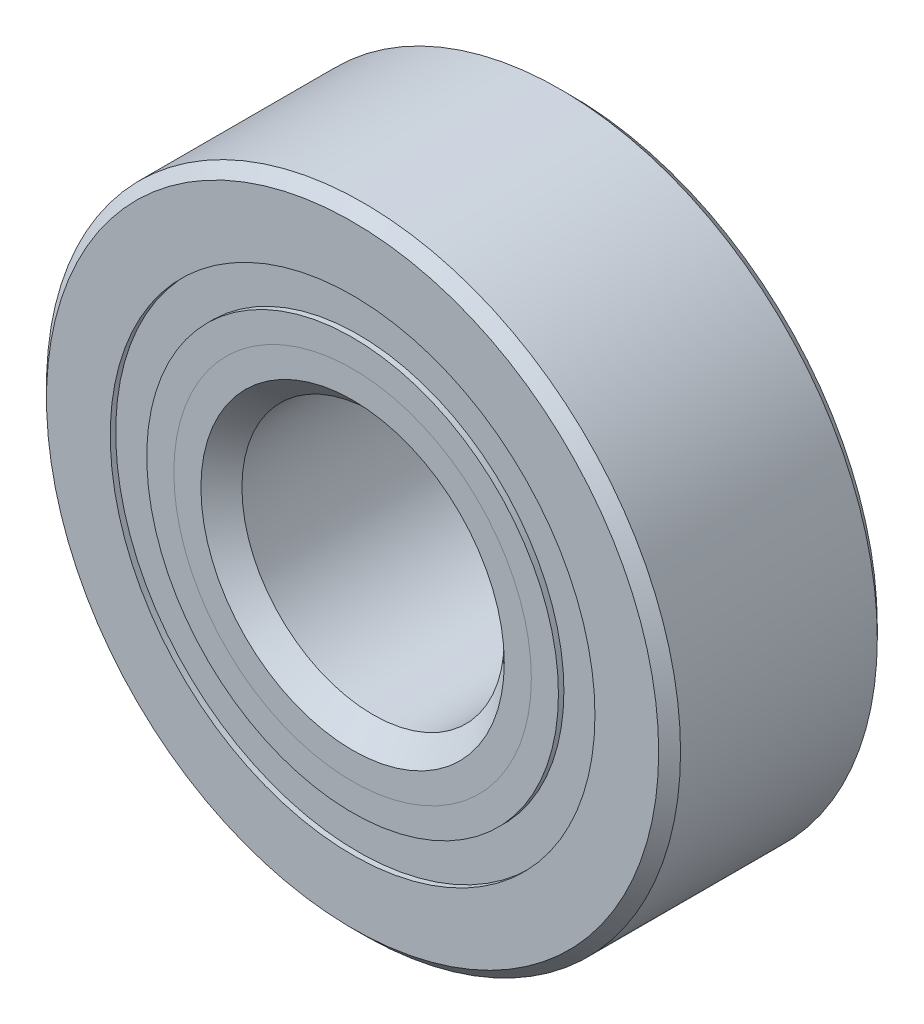
ISO-10303-21;
HEADER;
FILE_DESCRIPTION(('STEP AP214'),'2;1');
FILE_NAME('part.step','',(''),(''),'','','');
FILE_SCHEMA(('AUTOMOTIVE_DESIGN { 1 0 10303 214 1 1 1 1 }'));
ENDSEC;
DATA;
#1=APPLICATION_CONTEXT('core data for automotive mechanical design processes');
#2=APPLICATION_PROTOCOL_DEFINITION('international standard','automotive_design',2000,#1);
#3=PRODUCT_CONTEXT('',#1,'mechanical');
#4=PRODUCT('Part','Part','',(#3));
#5=PRODUCT_RELATED_PRODUCT_CATEGORY('part','',(#4));
#6=PRODUCT_DEFINITION_FORMATION('','',#4);
#7=PRODUCT_DEFINITION_CONTEXT('part definition',#1,'design');
#8=PRODUCT_DEFINITION('design','',#6,#7);
#9=PRODUCT_DEFINITION_SHAPE('','',#8);
#10=(LENGTH_UNIT() NAMED_UNIT(*) SI_UNIT(.MILLI.,.METRE.));
#11=(NAMED_UNIT(*) PLANE_ANGLE_UNIT() SI_UNIT($,.RADIAN.));
#12=(NAMED_UNIT(*) SI_UNIT($,.STERADIAN.) SOLID_ANGLE_UNIT());
#13=UNCERTAINTY_MEASURE_WITH_UNIT(LENGTH_MEASURE(1.E-05),#10,'distance_accuracy_value','');
#14=(GEOMETRIC_REPRESENTATION_CONTEXT(3) GLOBAL_UNCERTAINTY_ASSIGNED_CONTEXT((#13)) GLOBAL_UNIT_ASSIGNED_CONTEXT((#10,
#11,#12)) REPRESENTATION_CONTEXT('',''));
#15=CARTESIAN_POINT('',(0.,0.,0.));
#16=DIRECTION('',(0.,0.,1.));
#17=DIRECTION('',(1.,0.,0.));
#18=AXIS2_PLACEMENT_3D('',#15,#16,#17);
#19=CARTESIAN_POINT('',(0.,8.79884958791209,-3.7703125));
#20=DIRECTION('',(0.,0.,1.));
#21=DIRECTION('',(1.,0.,0.));
#22=AXIS2_PLACEMENT_3D('',#19,#20,#21);
#23=PLANE('',#22);
#24=CARTESIAN_POINT('',(0.,0.,-3.7703125));
#25=DIRECTION('',(0.,0.,1.));
#26=DIRECTION('',(1.,0.,0.));
#27=AXIS2_PLACEMENT_3D('',#24,#25,#26);
#28=CIRCLE('',#27,8.79884958791209);
#29=CARTESIAN_POINT('',(8.79884958791209,0.,-3.7703125));
#30=VERTEX_POINT('',#29);
#31=EDGE_CURVE('E55',#30,#30,#28,.T.);
#32=ORIENTED_EDGE('',*,*,#31,.F.);
#33=EDGE_LOOP('',(#32));
#34=FACE_BOUND('',#33,.T.);
#35=CARTESIAN_POINT('',(0.,0.,-3.7703125));
#36=DIRECTION('',(0.,0.,1.));
#37=DIRECTION('',(1.,0.,0.));
#38=AXIS2_PLACEMENT_3D('',#35,#36,#37);
#39=CIRCLE('',#38,7.47302541208792);
#40=CARTESIAN_POINT('',(7.47302541208792,0.,-3.7703125));
#41=VERTEX_POINT('',#40);
#42=EDGE_CURVE('E11',#41,#41,#39,.T.);
#43=ORIENTED_EDGE('',*,*,#42,.T.);
#44=EDGE_LOOP('',(#43));
#45=FACE_BOUND('',#44,.T.);
#46=ADVANCED_FACE('F41',(#34,#45),#23,.F.);
#47=CARTESIAN_POINT('',(0.,0.,3.96875));
#48=DIRECTION('',(0.,0.,1.));
#49=DIRECTION('',(1.,0.,0.));
#50=AXIS2_PLACEMENT_3D('',#47,#48,#49);
#51=CYLINDRICAL_SURFACE('',#50,7.47302541208792);
#52=ORIENTED_EDGE('',*,*,#42,.F.);
#53=EDGE_LOOP('',(#52));
#54=FACE_BOUND('',#53,.T.);
#55=CARTESIAN_POINT('',(0.,0.,-1.88434509807669));
#56=DIRECTION('',(0.,0.,1.));
#57=DIRECTION('',(1.,0.,0.));
#58=AXIS2_PLACEMENT_3D('',#55,#56,#57);
#59=CIRCLE('',#58,7.47302541208792);
#60=CARTESIAN_POINT('',(7.47302541208792,0.,-1.88434509807669));
#61=VERTEX_POINT('',#60);
#62=EDGE_CURVE('E47',#61,#61,#59,.T.);
#63=ORIENTED_EDGE('',*,*,#62,.T.);
#64=EDGE_LOOP('',(#63));
#65=FACE_BOUND('',#64,.T.);
#66=ADVANCED_FACE('F64',(#54,#65),#51,.F.);
#67=CARTESIAN_POINT('',(0.,8.79884958791209,-1.88434509807669));
#68=DIRECTION('',(0.,0.,-1.));
#69=DIRECTION('',(-1.,0.,0.));
#70=AXIS2_PLACEMENT_3D('',#67,#68,#69);
#71=PLANE('',#70);
#72=ORIENTED_EDGE('',*,*,#62,.F.);
#73=EDGE_LOOP('',(#72));
#74=FACE_BOUND('',#73,.T.);
#75=CARTESIAN_POINT('',(0.,0.,-1.88434509807669));
#76=DIRECTION('',(0.,0.,1.));
#77=DIRECTION('',(1.,0.,0.));
#78=AXIS2_PLACEMENT_3D('',#75,#76,#77);
#79=CIRCLE('',#78,8.79884958791209);
#80=CARTESIAN_POINT('',(8.79884958791209,0.,-1.88434509807669));
#81=VERTEX_POINT('',#80);
#82=EDGE_CURVE('E51',#81,#81,#79,.T.);
#83=ORIENTED_EDGE('',*,*,#82,.T.);
#84=EDGE_LOOP('',(#83));
#85=FACE_BOUND('',#84,.T.);
#86=ADVANCED_FACE('F68',(#74,#85),#71,.F.);
#87=CARTESIAN_POINT('',(0.,0.,3.96875));
#88=DIRECTION('',(0.,0.,1.));
#89=DIRECTION('',(1.,0.,0.));
#90=AXIS2_PLACEMENT_3D('',#87,#88,#89);
#91=CYLINDRICAL_SURFACE('',#90,8.79884958791209);
#92=ORIENTED_EDGE('',*,*,#82,.F.);
#93=EDGE_LOOP('',(#92));
#94=FACE_BOUND('',#93,.T.);
#95=ORIENTED_EDGE('',*,*,#31,.T.);
#96=EDGE_LOOP('',(#95));
#97=FACE_BOUND('',#96,.T.);
#98=ADVANCED_FACE('F61',(#94,#97),#91,.T.);
#99=CLOSED_SHELL('',(#46,#66,#86,#98));
#100=MANIFOLD_SOLID_BREP('B2',#99);
#101=CARTESIAN_POINT('',(0.,8.79884958791209,3.7703125));
#102=DIRECTION('',(0.,0.,-1.));
#103=DIRECTION('',(-1.,0.,0.));
#104=AXIS2_PLACEMENT_3D('',#101,#102,#103);
#105=PLANE('',#104);
#106=CARTESIAN_POINT('',(0.,0.,3.7703125));
#107=DIRECTION('',(0.,0.,1.));
#108=DIRECTION('',(1.,0.,0.));
#109=AXIS2_PLACEMENT_3D('',#106,#107,#108);
#110=CIRCLE('',#109,7.47302541208791);
#111=CARTESIAN_POINT('',(7.47302541208791,0.,3.7703125));
#112=VERTEX_POINT('',#111);
#113=EDGE_CURVE('E40',#112,#112,#110,.T.);
#114=ORIENTED_EDGE('',*,*,#113,.F.);
#115=EDGE_LOOP('',(#114));
#116=FACE_BOUND('',#115,.T.);
#117=CARTESIAN_POINT('',(0.,0.,3.7703125));
#118=DIRECTION('',(0.,0.,1.));
#119=DIRECTION('',(1.,0.,0.));
#120=AXIS2_PLACEMENT_3D('',#117,#118,#119);
#121=CIRCLE('',#120,8.79884958791209);
#122=CARTESIAN_POINT('',(8.79884958791209,0.,3.7703125));
#123=VERTEX_POINT('',#122);
#124=EDGE_CURVE('E122',#123,#123,#121,.T.);
#125=ORIENTED_EDGE('',*,*,#124,.T.);
#126=EDGE_LOOP('',(#125));
#127=FACE_BOUND('',#126,.T.);
#128=ADVANCED_FACE('F108',(#116,#127),#105,.F.);
#129=CARTESIAN_POINT('',(0.,0.,3.96875));
#130=DIRECTION('',(0.,0.,1.));
#131=DIRECTION('',(1.,0.,0.));
#132=AXIS2_PLACEMENT_3D('',#129,#130,#131);
#133=CYLINDRICAL_SURFACE('',#132,7.47302541208791);
#134=CARTESIAN_POINT('',(0.,0.,1.88434509807669));
#135=DIRECTION('',(0.,0.,1.));
#136=DIRECTION('',(1.,0.,0.));
#137=AXIS2_PLACEMENT_3D('',#134,#135,#136);
#138=CIRCLE('',#137,7.47302541208791);
#139=CARTESIAN_POINT('',(7.47302541208791,0.,1.88434509807669));
#140=VERTEX_POINT('',#139);
#141=EDGE_CURVE('E114',#140,#140,#138,.T.);
#142=ORIENTED_EDGE('',*,*,#141,.F.);
#143=EDGE_LOOP('',(#142));
#144=FACE_BOUND('',#143,.T.);
#145=ORIENTED_EDGE('',*,*,#113,.T.);
#146=EDGE_LOOP('',(#145));
#147=FACE_BOUND('',#146,.T.);
#148=ADVANCED_FACE('F137',(#144,#147),#133,.F.);
#149=CARTESIAN_POINT('',(0.,8.79884958791209,1.88434509807669));
#150=DIRECTION('',(0.,0.,1.));
#151=DIRECTION('',(1.,0.,0.));
#152=AXIS2_PLACEMENT_3D('',#149,#150,#151);
#153=PLANE('',#152);
#154=CARTESIAN_POINT('',(0.,0.,1.88434509807669));
#155=DIRECTION('',(0.,0.,1.));
#156=DIRECTION('',(1.,0.,0.));
#157=AXIS2_PLACEMENT_3D('',#154,#155,#156);
#158=CIRCLE('',#157,8.79884958791209);
#159=CARTESIAN_POINT('',(8.79884958791209,0.,1.88434509807669));
#160=VERTEX_POINT('',#159);
#161=EDGE_CURVE('E118',#160,#160,#158,.T.);
#162=ORIENTED_EDGE('',*,*,#161,.F.);
#163=EDGE_LOOP('',(#162));
#164=FACE_BOUND('',#163,.T.);
#165=ORIENTED_EDGE('',*,*,#141,.T.);
#166=EDGE_LOOP('',(#165));
#167=FACE_BOUND('',#166,.T.);
#168=ADVANCED_FACE('F132',(#164,#167),#153,.F.);
#169=CARTESIAN_POINT('',(0.,0.,3.96875));
#170=DIRECTION('',(0.,0.,1.));
#171=DIRECTION('',(1.,0.,0.));
#172=AXIS2_PLACEMENT_3D('',#169,#170,#171);
#173=CYLINDRICAL_SURFACE('',#172,8.79884958791209);
#174=ORIENTED_EDGE('',*,*,#124,.F.);
#175=EDGE_LOOP('',(#174));
#176=FACE_BOUND('',#175,.T.);
#177=ORIENTED_EDGE('',*,*,#161,.T.);
#178=EDGE_LOOP('',(#177));
#179=FACE_BOUND('',#178,.T.);
#180=ADVANCED_FACE('F129',(#176,#179),#173,.T.);
#181=CLOSED_SHELL('',(#128,#148,#168,#180));
#182=MANIFOLD_SOLID_BREP('B6',#181);
#183=CARTESIAN_POINT('',(-4.06796874999991,7.04592855860251,0.));
#184=DIRECTION('',(0.,0.,1.));
#185=DIRECTION('',(-0.499999999999989,0.866025403784445,0.));
#186=AXIS2_PLACEMENT_3D('',#183,#184,#185);
#187=SPHERICAL_SURFACE('',#186,1.88434509807669);
#188=CARTESIAN_POINT('',(-4.06796874999991,7.04592855860251,1.88434509807669));
#189=VERTEX_POINT('',#188);
#190=VERTEX_LOOP('',#189);
#191=FACE_BOUND('',#190,.T.);
#192=ADVANCED_FACE('F175',(#191),#187,.T.);
#193=CLOSED_SHELL('',(#192));
#194=MANIFOLD_SOLID_BREP('B35',#193);
#195=CARTESIAN_POINT('',(-7.04592855860241,4.06796875000008,0.));
#196=DIRECTION('',(0.,0.,1.));
#197=DIRECTION('',(-0.866025403784433,0.50000000000001,0.));
#198=AXIS2_PLACEMENT_3D('',#195,#196,#197);
#199=SPHERICAL_SURFACE('',#198,1.88434509807669);
#200=CARTESIAN_POINT('',(-7.04592855860241,4.06796875000008,1.88434509807669));
#201=VERTEX_POINT('',#200);
#202=VERTEX_LOOP('',#201);
#203=FACE_BOUND('',#202,.T.);
#204=ADVANCED_FACE('F206',(#203),#199,.T.);
#205=CLOSED_SHELL('',(#204));
#206=MANIFOLD_SOLID_BREP('B104',#205);
#207=CARTESIAN_POINT('',(-8.1359375,0.,0.));
#208=DIRECTION('',(0.,0.,1.));
#209=DIRECTION('',(-1.,0.,0.));
#210=AXIS2_PLACEMENT_3D('',#207,#208,#209);
#211=SPHERICAL_SURFACE('',#210,1.88434509807669);
#212=CARTESIAN_POINT('',(-8.1359375,0.,1.88434509807669));
#213=VERTEX_POINT('',#212);
#214=VERTEX_LOOP('',#213);
#215=FACE_BOUND('',#214,.T.);
#216=ADVANCED_FACE('F237',(#215),#211,.T.);
#217=CLOSED_SHELL('',(#216));
#218=MANIFOLD_SOLID_BREP('B171',#217);
#219=CARTESIAN_POINT('',(-7.04592855860249,-4.06796874999993,0.));
#220=DIRECTION('',(0.,0.,1.));
#221=DIRECTION('',(-0.866025403784443,-0.499999999999992,0.));
#222=AXIS2_PLACEMENT_3D('',#219,#220,#221);
#223=SPHERICAL_SURFACE('',#222,1.88434509807669);
#224=CARTESIAN_POINT('',(-7.04592855860249,-4.06796874999993,1.88434509807669));
#225=VERTEX_POINT('',#224);
#226=VERTEX_LOOP('',#225);
#227=FACE_BOUND('',#226,.T.);
#228=ADVANCED_FACE('F268',(#227),#223,.T.);
#229=CLOSED_SHELL('',(#228));
#230=MANIFOLD_SOLID_BREP('B202',#229);
#231=CARTESIAN_POINT('',(-4.06796875000006,-7.04592855860242,0.));
#232=DIRECTION('',(0.,0.,1.));
#233=DIRECTION('',(-0.500000000000007,-0.866025403784435,0.));
#234=AXIS2_PLACEMENT_3D('',#231,#232,#233);
#235=SPHERICAL_SURFACE('',#234,1.88434509807669);
#236=CARTESIAN_POINT('',(-4.06796875000006,-7.04592855860242,1.88434509807669));
#237=VERTEX_POINT('',#236);
#238=VERTEX_LOOP('',#237);
#239=FACE_BOUND('',#238,.T.);
#240=ADVANCED_FACE('F299',(#239),#235,.T.);
#241=CLOSED_SHELL('',(#240));
#242=MANIFOLD_SOLID_BREP('B233',#241);
#243=CARTESIAN_POINT('',(0.,-8.1359375,0.));
#244=DIRECTION('',(0.,0.,1.));
#245=DIRECTION('',(0.,-1.,0.));
#246=AXIS2_PLACEMENT_3D('',#243,#244,#245);
#247=SPHERICAL_SURFACE('',#246,1.88434509807669);
#248=CARTESIAN_POINT('',(0.,-8.1359375,1.88434509807669));
#249=VERTEX_POINT('',#248);
#250=VERTEX_LOOP('',#249);
#251=FACE_BOUND('',#250,.T.);
#252=ADVANCED_FACE('F330',(#251),#247,.T.);
#253=CLOSED_SHELL('',(#252));
#254=MANIFOLD_SOLID_BREP('B264',#253);
#255=CARTESIAN_POINT('',(4.06796874999996,-7.04592855860248,0.));
#256=DIRECTION('',(0.,0.,1.));
#257=DIRECTION('',(0.499999999999995,-0.866025403784442,0.));
#258=AXIS2_PLACEMENT_3D('',#255,#256,#257);
#259=SPHERICAL_SURFACE('',#258,1.88434509807669);
#260=CARTESIAN_POINT('',(4.06796874999996,-7.04592855860248,1.88434509807669));
#261=VERTEX_POINT('',#260);
#262=VERTEX_LOOP('',#261);
#263=FACE_BOUND('',#262,.T.);
#264=ADVANCED_FACE('F361',(#263),#259,.T.);
#265=CLOSED_SHELL('',(#264));
#266=MANIFOLD_SOLID_BREP('B295',#265);
#267=CARTESIAN_POINT('',(7.04592855860244,-4.06796875000003,0.));
#268=DIRECTION('',(0.,0.,1.));
#269=DIRECTION('',(0.866025403784436,-0.500000000000004,0.));
#270=AXIS2_PLACEMENT_3D('',#267,#268,#269);
#271=SPHERICAL_SURFACE('',#270,1.88434509807669);
#272=CARTESIAN_POINT('',(7.04592855860244,-4.06796875000003,1.88434509807669));
#273=VERTEX_POINT('',#272);
#274=VERTEX_LOOP('',#273);
#275=FACE_BOUND('',#274,.T.);
#276=ADVANCED_FACE('F392',(#275),#271,.T.);
#277=CLOSED_SHELL('',(#276));
#278=MANIFOLD_SOLID_BREP('B326',#277);
#279=CARTESIAN_POINT('',(8.1359375,0.,0.));
#280=DIRECTION('',(0.,0.,1.));
#281=DIRECTION('',(1.,0.,0.));
#282=AXIS2_PLACEMENT_3D('',#279,#280,#281);
#283=SPHERICAL_SURFACE('',#282,1.88434509807669);
#284=CARTESIAN_POINT('',(8.1359375,0.,1.88434509807669));
#285=VERTEX_POINT('',#284);
#286=VERTEX_LOOP('',#285);
#287=FACE_BOUND('',#286,.T.);
#288=ADVANCED_FACE('F423',(#287),#283,.T.);
#289=CLOSED_SHELL('',(#288));
#290=MANIFOLD_SOLID_BREP('B357',#289);
#291=CARTESIAN_POINT('',(7.04592855860247,4.06796874999998,0.));
#292=DIRECTION('',(0.,0.,1.));
#293=DIRECTION('',(0.86602540378444,0.499999999999998,0.));
#294=AXIS2_PLACEMENT_3D('',#291,#292,#293);
#295=SPHERICAL_SURFACE('',#294,1.88434509807669);
#296=CARTESIAN_POINT('',(7.04592855860247,4.06796874999998,1.88434509807669));
#297=VERTEX_POINT('',#296);
#298=VERTEX_LOOP('',#297);
#299=FACE_BOUND('',#298,.T.);
#300=ADVANCED_FACE('F454',(#299),#295,.T.);
#301=CLOSED_SHELL('',(#300));
#302=MANIFOLD_SOLID_BREP('B388',#301);
#303=CARTESIAN_POINT('',(4.06796875000001,7.04592855860245,0.));
#304=DIRECTION('',(0.,0.,1.));
#305=DIRECTION('',(0.500000000000001,0.866025403784438,0.));
#306=AXIS2_PLACEMENT_3D('',#303,#304,#305);
#307=SPHERICAL_SURFACE('',#306,1.88434509807669);
#308=CARTESIAN_POINT('',(4.06796875000001,7.04592855860245,1.88434509807669));
#309=VERTEX_POINT('',#308);
#310=VERTEX_LOOP('',#309);
#311=FACE_BOUND('',#310,.T.);
#312=ADVANCED_FACE('F485',(#311),#307,.T.);
#313=CLOSED_SHELL('',(#312));
#314=MANIFOLD_SOLID_BREP('B419',#313);
#315=CARTESIAN_POINT('',(0.,8.1359375,0.));
#316=DIRECTION('',(0.,0.,1.));
#317=DIRECTION('',(0.,1.,0.));
#318=AXIS2_PLACEMENT_3D('',#315,#316,#317);
#319=SPHERICAL_SURFACE('',#318,1.88434509807669);
#320=CARTESIAN_POINT('',(0.,8.1359375,1.88434509807669));
#321=VERTEX_POINT('',#320);
#322=VERTEX_LOOP('',#321);
#323=FACE_BOUND('',#322,.T.);
#324=ADVANCED_FACE('F518',(#323),#319,.T.);
#325=CLOSED_SHELL('',(#324));
#326=MANIFOLD_SOLID_BREP('B450',#325);
#327=CARTESIAN_POINT('',(0.,6.49003580652479,3.96875));
#328=DIRECTION('',(0.,0.,-1.));
#329=DIRECTION('',(-1.,0.,0.));
#330=AXIS2_PLACEMENT_3D('',#327,#328,#329);
#331=PLANE('',#330);
#332=CARTESIAN_POINT('',(0.,0.,3.96875));
#333=DIRECTION('',(0.,0.,1.));
#334=DIRECTION('',(1.,0.,0.));
#335=AXIS2_PLACEMENT_3D('',#332,#333,#334);
#336=CIRCLE('',#335,5.50704620096166);
#337=CARTESIAN_POINT('',(5.50704620096166,0.,3.96875));
#338=VERTEX_POINT('',#337);
#339=EDGE_CURVE('E572',#338,#338,#336,.T.);
#340=ORIENTED_EDGE('',*,*,#339,.F.);
#341=EDGE_LOOP('',(#340));
#342=FACE_BOUND('',#341,.T.);
#343=CARTESIAN_POINT('',(0.,0.,3.96875));
#344=DIRECTION('',(0.,0.,1.));
#345=DIRECTION('',(1.,0.,0.));
#346=AXIS2_PLACEMENT_3D('',#343,#344,#345);
#347=CIRCLE('',#346,6.49003580652479);
#348=CARTESIAN_POINT('',(6.49003580652479,0.,3.96875));
#349=VERTEX_POINT('',#348);
#350=EDGE_CURVE('E517',#349,#349,#347,.T.);
#351=ORIENTED_EDGE('',*,*,#350,.T.);
#352=EDGE_LOOP('',(#351));
#353=FACE_BOUND('',#352,.T.);
#354=ADVANCED_FACE('F538',(#342,#353),#331,.F.);
#355=CARTESIAN_POINT('',(0.,0.,2.98576039443688));
#356=DIRECTION('',(0.,0.,1.));
#357=DIRECTION('',(1.,0.,0.));
#358=AXIS2_PLACEMENT_3D('',#355,#356,#357);
#359=CONICAL_SURFACE('',#358,5.50704620096166,0.78539816339745);
#360=ORIENTED_EDGE('',*,*,#350,.F.);
#361=EDGE_LOOP('',(#360));
#362=FACE_BOUND('',#361,.T.);
#363=CARTESIAN_POINT('',(0.,0.,2.98576039443688));
#364=DIRECTION('',(0.,0.,1.));
#365=DIRECTION('',(1.,0.,0.));
#366=AXIS2_PLACEMENT_3D('',#363,#364,#365);
#367=CIRCLE('',#366,5.50704620096166);
#368=CARTESIAN_POINT('',(5.50704620096166,0.,2.98576039443688));
#369=VERTEX_POINT('',#368);
#370=EDGE_CURVE('E544',#369,#369,#367,.T.);
#371=ORIENTED_EDGE('',*,*,#370,.T.);
#372=EDGE_LOOP('',(#371));
#373=FACE_BOUND('',#372,.T.);
#374=ADVANCED_FACE('F579',(#362,#373),#359,.T.);
#375=CARTESIAN_POINT('',(0.,0.,3.96875));
#376=DIRECTION('',(0.,0.,1.));
#377=DIRECTION('',(1.,0.,0.));
#378=AXIS2_PLACEMENT_3D('',#375,#376,#377);
#379=CYLINDRICAL_SURFACE('',#378,5.50704620096166);
#380=ORIENTED_EDGE('',*,*,#370,.F.);
#381=EDGE_LOOP('',(#380));
#382=FACE_BOUND('',#381,.T.);
#383=CARTESIAN_POINT('',(0.,0.,0.));
#384=DIRECTION('',(0.,0.,1.));
#385=DIRECTION('',(1.,0.,0.));
#386=AXIS2_PLACEMENT_3D('',#383,#384,#385);
#387=CIRCLE('',#386,5.50704620096166);
#388=CARTESIAN_POINT('',(5.50704620096166,0.,0.));
#389=VERTEX_POINT('',#388);
#390=EDGE_CURVE('E548',#389,#389,#387,.T.);
#391=ORIENTED_EDGE('',*,*,#390,.T.);
#392=EDGE_LOOP('',(#391));
#393=FACE_BOUND('',#392,.T.);
#394=ADVANCED_FACE('F583',(#382,#393),#379,.T.);
#395=CARTESIAN_POINT('',(0.,5.50704620096166,0.));
#396=DIRECTION('',(0.,0.,-1.));
#397=DIRECTION('',(-1.,0.,0.));
#398=AXIS2_PLACEMENT_3D('',#395,#396,#397);
#399=PLANE('',#398);
#400=ORIENTED_EDGE('',*,*,#390,.F.);
#401=EDGE_LOOP('',(#400));
#402=FACE_BOUND('',#401,.T.);
#403=CARTESIAN_POINT('',(0.,0.,0.));
#404=DIRECTION('',(0.,0.,1.));
#405=DIRECTION('',(1.,0.,0.));
#406=AXIS2_PLACEMENT_3D('',#403,#404,#405);
#407=CIRCLE('',#406,6.25159240192331);
#408=CARTESIAN_POINT('',(6.25159240192331,0.,0.));
#409=VERTEX_POINT('',#408);
#410=EDGE_CURVE('E552',#409,#409,#407,.T.);
#411=ORIENTED_EDGE('',*,*,#410,.T.);
#412=EDGE_LOOP('',(#411));
#413=FACE_BOUND('',#412,.T.);
#414=ADVANCED_FACE('F588',(#402,#413),#399,.F.);
#415=CARTESIAN_POINT('',(0.,0.,0.));
#416=DIRECTION('',(0.,0.,1.));
#417=DIRECTION('',(1.,0.,0.));
#418=AXIS2_PLACEMENT_3D('',#415,#416,#417);
#419=TOROIDAL_SURFACE('',#418,8.1359375,1.88434509807669);
#420=ORIENTED_EDGE('',*,*,#410,.F.);
#421=EDGE_LOOP('',(#420));
#422=FACE_BOUND('',#421,.T.);
#423=CARTESIAN_POINT('',(0.,0.,-1.76388888888889));
#424=DIRECTION('',(0.,0.,1.));
#425=DIRECTION('',(1.,0.,0.));
#426=AXIS2_PLACEMENT_3D('',#423,#424,#425);
#427=CIRCLE('',#426,7.47302541208791);
#428=CARTESIAN_POINT('',(7.47302541208791,0.,-1.76388888888889));
#429=VERTEX_POINT('',#428);
#430=EDGE_CURVE('E557',#429,#429,#427,.T.);
#431=ORIENTED_EDGE('',*,*,#430,.T.);
#432=EDGE_LOOP('',(#431));
#433=FACE_BOUND('',#432,.T.);
#434=ADVANCED_FACE('F594',(#422,#433),#419,.F.);
#435=CARTESIAN_POINT('',(0.,0.,3.96875));
#436=DIRECTION('',(0.,0.,1.));
#437=DIRECTION('',(1.,0.,0.));
#438=AXIS2_PLACEMENT_3D('',#435,#436,#437);
#439=CYLINDRICAL_SURFACE('',#438,7.47302541208792);
#440=ORIENTED_EDGE('',*,*,#430,.F.);
#441=EDGE_LOOP('',(#440));
#442=FACE_BOUND('',#441,.T.);
#443=CARTESIAN_POINT('',(0.,0.,-3.96875000000001));
#444=DIRECTION('',(0.,0.,1.));
#445=DIRECTION('',(1.,0.,0.));
#446=AXIS2_PLACEMENT_3D('',#443,#444,#445);
#447=CIRCLE('',#446,7.47302541208792);
#448=CARTESIAN_POINT('',(7.47302541208792,0.,-3.96875000000001));
#449=VERTEX_POINT('',#448);
#450=EDGE_CURVE('E560',#449,#449,#447,.T.);
#451=ORIENTED_EDGE('',*,*,#450,.T.);
#452=EDGE_LOOP('',(#451));
#453=FACE_BOUND('',#452,.T.);
#454=ADVANCED_FACE('F598',(#442,#453),#439,.T.);
#455=CARTESIAN_POINT('',(0.,5.159375,-3.96875));
#456=DIRECTION('',(0.,0.,1.));
#457=DIRECTION('',(1.,0.,0.));
#458=AXIS2_PLACEMENT_3D('',#455,#456,#457);
#459=PLANE('',#458);
#460=ORIENTED_EDGE('',*,*,#450,.F.);
#461=EDGE_LOOP('',(#460));
#462=FACE_BOUND('',#461,.T.);
#463=CARTESIAN_POINT('',(0.,0.,-3.96875));
#464=DIRECTION('',(0.,0.,1.));
#465=DIRECTION('',(1.,0.,0.));
#466=AXIS2_PLACEMENT_3D('',#463,#464,#465);
#467=CIRCLE('',#466,5.159375);
#468=CARTESIAN_POINT('',(5.159375,0.,-3.96875));
#469=VERTEX_POINT('',#468);
#470=EDGE_CURVE('E563',#469,#469,#467,.T.);
#471=ORIENTED_EDGE('',*,*,#470,.T.);
#472=EDGE_LOOP('',(#471));
#473=FACE_BOUND('',#472,.T.);
#474=ADVANCED_FACE('F602',(#462,#473),#459,.F.);
#475=CARTESIAN_POINT('',(0.,0.,-3.571875));
#476=DIRECTION('',(0.,0.,-1.));
#477=DIRECTION('',(-1.,0.,0.));
#478=AXIS2_PLACEMENT_3D('',#475,#476,#477);
#479=CONICAL_SURFACE('',#478,4.7625,0.785398163397448);
#480=ORIENTED_EDGE('',*,*,#470,.F.);
#481=EDGE_LOOP('',(#480));
#482=FACE_BOUND('',#481,.T.);
#483=CARTESIAN_POINT('',(0.,0.,-3.571875));
#484=DIRECTION('',(0.,0.,1.));
#485=DIRECTION('',(1.,0.,0.));
#486=AXIS2_PLACEMENT_3D('',#483,#484,#485);
#487=CIRCLE('',#486,4.7625);
#488=CARTESIAN_POINT('',(4.7625,0.,-3.571875));
#489=VERTEX_POINT('',#488);
#490=EDGE_CURVE('E566',#489,#489,#487,.T.);
#491=ORIENTED_EDGE('',*,*,#490,.T.);
#492=EDGE_LOOP('',(#491));
#493=FACE_BOUND('',#492,.T.);
#494=ADVANCED_FACE('F606',(#482,#493),#479,.F.);
#495=CARTESIAN_POINT('',(0.,0.,3.96875));
#496=DIRECTION('',(0.,0.,1.));
#497=DIRECTION('',(1.,0.,0.));
#498=AXIS2_PLACEMENT_3D('',#495,#496,#497);
#499=CYLINDRICAL_SURFACE('',#498,4.7625);
#500=ORIENTED_EDGE('',*,*,#490,.F.);
#501=EDGE_LOOP('',(#500));
#502=FACE_BOUND('',#501,.T.);
#503=CARTESIAN_POINT('',(0.,0.,3.22420379903835));
#504=DIRECTION('',(0.,0.,1.));
#505=DIRECTION('',(1.,0.,0.));
#506=AXIS2_PLACEMENT_3D('',#503,#504,#505);
#507=CIRCLE('',#506,4.7625);
#508=CARTESIAN_POINT('',(4.7625,0.,3.22420379903835));
#509=VERTEX_POINT('',#508);
#510=EDGE_CURVE('E569',#509,#509,#507,.T.);
#511=ORIENTED_EDGE('',*,*,#510,.T.);
#512=EDGE_LOOP('',(#511));
#513=FACE_BOUND('',#512,.T.);
#514=ADVANCED_FACE('F610',(#502,#513),#499,.F.);
#515=CARTESIAN_POINT('',(0.,0.,3.96875));
#516=DIRECTION('',(0.,0.,1.));
#517=DIRECTION('',(1.,0.,0.));
#518=AXIS2_PLACEMENT_3D('',#515,#516,#517);
#519=CONICAL_SURFACE('',#518,5.50704620096166,0.78539816339745);
#520=ORIENTED_EDGE('',*,*,#510,.F.);
#521=EDGE_LOOP('',(#520));
#522=FACE_BOUND('',#521,.T.);
#523=ORIENTED_EDGE('',*,*,#339,.T.);
#524=EDGE_LOOP('',(#523));
#525=FACE_BOUND('',#524,.T.);
#526=ADVANCED_FACE('F576',(#522,#525),#519,.F.);
#527=CLOSED_SHELL('',(#354,#374,#394,#414,#434,#454,#474,#494,#514,#526));
#528=MANIFOLD_SOLID_BREP('B481',#527);
#529=CARTESIAN_POINT('',(0.,7.47302541208791,3.96875));
#530=DIRECTION('',(0.,0.,-1.));
#531=DIRECTION('',(-1.,0.,0.));
#532=AXIS2_PLACEMENT_3D('',#529,#530,#531);
#533=PLANE('',#532);
#534=CARTESIAN_POINT('',(0.,0.,3.96875));
#535=DIRECTION('',(0.,0.,1.));
#536=DIRECTION('',(1.,0.,0.));
#537=AXIS2_PLACEMENT_3D('',#534,#535,#536);
#538=CIRCLE('',#537,6.49003580652479);
#539=CARTESIAN_POINT('',(6.49003580652479,0.,3.96875));
#540=VERTEX_POINT('',#539);
#541=EDGE_CURVE('E537',#540,#540,#538,.T.);
#542=ORIENTED_EDGE('',*,*,#541,.F.);
#543=EDGE_LOOP('',(#542));
#544=FACE_BOUND('',#543,.T.);
#545=CARTESIAN_POINT('',(0.,0.,3.96875));
#546=DIRECTION('',(0.,0.,1.));
#547=DIRECTION('',(1.,0.,0.));
#548=AXIS2_PLACEMENT_3D('',#545,#546,#547);
#549=CIRCLE('',#548,7.47302541208791);
#550=CARTESIAN_POINT('',(7.47302541208791,0.,3.96875));
#551=VERTEX_POINT('',#550);
#552=EDGE_CURVE('E718',#551,#551,#549,.T.);
#553=ORIENTED_EDGE('',*,*,#552,.T.);
#554=EDGE_LOOP('',(#553));
#555=FACE_BOUND('',#554,.T.);
#556=ADVANCED_FACE('F696',(#544,#555),#533,.F.);
#557=CARTESIAN_POINT('',(0.,0.,3.96875));
#558=DIRECTION('',(0.,0.,1.));
#559=DIRECTION('',(1.,0.,0.));
#560=AXIS2_PLACEMENT_3D('',#557,#558,#559);
#561=CONICAL_SURFACE('',#560,6.49003580652479,0.78539816339745);
#562=CARTESIAN_POINT('',(0.,0.,2.98576039443688));
#563=DIRECTION('',(0.,0.,1.));
#564=DIRECTION('',(1.,0.,0.));
#565=AXIS2_PLACEMENT_3D('',#562,#563,#564);
#566=CIRCLE('',#565,5.50704620096166);
#567=CARTESIAN_POINT('',(5.50704620096166,0.,2.98576039443688));
#568=VERTEX_POINT('',#567);
#569=EDGE_CURVE('E702',#568,#568,#566,.T.);
#570=ORIENTED_EDGE('',*,*,#569,.F.);
#571=EDGE_LOOP('',(#570));
#572=FACE_BOUND('',#571,.T.);
#573=ORIENTED_EDGE('',*,*,#541,.T.);
#574=EDGE_LOOP('',(#573));
#575=FACE_BOUND('',#574,.T.);
#576=ADVANCED_FACE('F743',(#572,#575),#561,.F.);
#577=CARTESIAN_POINT('',(0.,0.,3.96875));
#578=DIRECTION('',(0.,0.,1.));
#579=DIRECTION('',(1.,0.,0.));
#580=AXIS2_PLACEMENT_3D('',#577,#578,#579);
#581=CYLINDRICAL_SURFACE('',#580,5.50704620096166);
#582=CARTESIAN_POINT('',(0.,0.,0.));
#583=DIRECTION('',(0.,0.,1.));
#584=DIRECTION('',(1.,0.,0.));
#585=AXIS2_PLACEMENT_3D('',#582,#583,#584);
#586=CIRCLE('',#585,5.50704620096166);
#587=CARTESIAN_POINT('',(5.50704620096166,0.,0.));
#588=VERTEX_POINT('',#587);
#589=EDGE_CURVE('E706',#588,#588,#586,.T.);
#590=ORIENTED_EDGE('',*,*,#589,.F.);
#591=EDGE_LOOP('',(#590));
#592=FACE_BOUND('',#591,.T.);
#593=ORIENTED_EDGE('',*,*,#569,.T.);
#594=EDGE_LOOP('',(#593));
#595=FACE_BOUND('',#594,.T.);
#596=ADVANCED_FACE('F738',(#592,#595),#581,.F.);
#597=CARTESIAN_POINT('',(0.,5.50704620096166,0.));
#598=DIRECTION('',(0.,0.,1.));
#599=DIRECTION('',(1.,0.,0.));
#600=AXIS2_PLACEMENT_3D('',#597,#598,#599);
#601=PLANE('',#600);
#602=CARTESIAN_POINT('',(0.,0.,0.));
#603=DIRECTION('',(0.,0.,1.));
#604=DIRECTION('',(1.,0.,0.));
#605=AXIS2_PLACEMENT_3D('',#602,#603,#604);
#606=CIRCLE('',#605,6.25159240192331);
#607=CARTESIAN_POINT('',(6.25159240192331,0.,0.));
#608=VERTEX_POINT('',#607);
#609=EDGE_CURVE('E710',#608,#608,#606,.T.);
#610=ORIENTED_EDGE('',*,*,#609,.F.);
#611=EDGE_LOOP('',(#610));
#612=FACE_BOUND('',#611,.T.);
#613=ORIENTED_EDGE('',*,*,#589,.T.);
#614=EDGE_LOOP('',(#613));
#615=FACE_BOUND('',#614,.T.);
#616=ADVANCED_FACE('F732',(#612,#615),#601,.F.);
#617=CARTESIAN_POINT('',(0.,0.,0.));
#618=DIRECTION('',(0.,0.,1.));
#619=DIRECTION('',(1.,0.,0.));
#620=AXIS2_PLACEMENT_3D('',#617,#618,#619);
#621=TOROIDAL_SURFACE('',#620,8.1359375,1.88434509807669);
#622=CARTESIAN_POINT('',(0.,0.,1.76388888888889));
#623=DIRECTION('',(0.,0.,1.));
#624=DIRECTION('',(1.,0.,0.));
#625=AXIS2_PLACEMENT_3D('',#622,#623,#624);
#626=CIRCLE('',#625,7.47302541208791);
#627=CARTESIAN_POINT('',(7.47302541208791,0.,1.76388888888889));
#628=VERTEX_POINT('',#627);
#629=EDGE_CURVE('E715',#628,#628,#626,.T.);
#630=ORIENTED_EDGE('',*,*,#629,.F.);
#631=EDGE_LOOP('',(#630));
#632=FACE_BOUND('',#631,.T.);
#633=ORIENTED_EDGE('',*,*,#609,.T.);
#634=EDGE_LOOP('',(#633));
#635=FACE_BOUND('',#634,.T.);
#636=ADVANCED_FACE('F726',(#632,#635),#621,.F.);
#637=CARTESIAN_POINT('',(0.,0.,3.96875));
#638=DIRECTION('',(0.,0.,1.));
#639=DIRECTION('',(1.,0.,0.));
#640=AXIS2_PLACEMENT_3D('',#637,#638,#639);
#641=CYLINDRICAL_SURFACE('',#640,7.47302541208791);
#642=ORIENTED_EDGE('',*,*,#552,.F.);
#643=EDGE_LOOP('',(#642));
#644=FACE_BOUND('',#643,.T.);
#645=ORIENTED_EDGE('',*,*,#629,.T.);
#646=EDGE_LOOP('',(#645));
#647=FACE_BOUND('',#646,.T.);
#648=ADVANCED_FACE('F723',(#644,#647),#641,.T.);
#649=CLOSED_SHELL('',(#556,#576,#596,#616,#636,#648));
#650=MANIFOLD_SOLID_BREP('B512',#649);
#651=CARTESIAN_POINT('',(0.,0.,3.571875));
#652=DIRECTION('',(0.,0.,-1.));
#653=DIRECTION('',(-1.,0.,0.));
#654=AXIS2_PLACEMENT_3D('',#651,#652,#653);
#655=CONICAL_SURFACE('',#654,11.509375,0.785398163397445);
#656=CARTESIAN_POINT('',(0.,0.,3.96875));
#657=DIRECTION('',(0.,0.,1.));
#658=DIRECTION('',(1.,0.,0.));
#659=AXIS2_PLACEMENT_3D('',#656,#657,#658);
#660=CIRCLE('',#659,11.1125);
#661=CARTESIAN_POINT('',(11.1125,0.,3.96875));
#662=VERTEX_POINT('',#661);
#663=EDGE_CURVE('E815',#662,#662,#660,.T.);
#664=ORIENTED_EDGE('',*,*,#663,.F.);
#665=EDGE_LOOP('',(#664));
#666=FACE_BOUND('',#665,.T.);
#667=CARTESIAN_POINT('',(0.,0.,3.571875));
#668=DIRECTION('',(0.,0.,1.));
#669=DIRECTION('',(1.,0.,0.));
#670=AXIS2_PLACEMENT_3D('',#667,#668,#669);
#671=CIRCLE('',#670,11.509375);
#672=CARTESIAN_POINT('',(11.509375,0.,3.571875));
#673=VERTEX_POINT('',#672);
#674=EDGE_CURVE('E695',#673,#673,#671,.T.);
#675=ORIENTED_EDGE('',*,*,#674,.T.);
#676=EDGE_LOOP('',(#675));
#677=FACE_BOUND('',#676,.T.);
#678=ADVANCED_FACE('F787',(#666,#677),#655,.T.);
#679=CARTESIAN_POINT('',(0.,0.,3.96875));
#680=DIRECTION('',(0.,0.,1.));
#681=DIRECTION('',(1.,0.,0.));
#682=AXIS2_PLACEMENT_3D('',#679,#680,#681);
#683=CYLINDRICAL_SURFACE('',#682,11.509375);
#684=ORIENTED_EDGE('',*,*,#674,.F.);
#685=EDGE_LOOP('',(#684));
#686=FACE_BOUND('',#685,.T.);
#687=CARTESIAN_POINT('',(0.,0.,-3.571875));
#688=DIRECTION('',(0.,0.,1.));
#689=DIRECTION('',(1.,0.,0.));
#690=AXIS2_PLACEMENT_3D('',#687,#688,#689);
#691=CIRCLE('',#690,11.509375);
#692=CARTESIAN_POINT('',(11.509375,0.,-3.571875));
#693=VERTEX_POINT('',#692);
#694=EDGE_CURVE('E793',#693,#693,#691,.T.);
#695=ORIENTED_EDGE('',*,*,#694,.T.);
#696=EDGE_LOOP('',(#695));
#697=FACE_BOUND('',#696,.T.);
#698=ADVANCED_FACE('F822',(#686,#697),#683,.T.);
#699=CARTESIAN_POINT('',(0.,0.,-3.96875000000001));
#700=DIRECTION('',(0.,0.,1.));
#701=DIRECTION('',(1.,0.,0.));
#702=AXIS2_PLACEMENT_3D('',#699,#700,#701);
#703=CONICAL_SURFACE('',#702,11.1125,0.785398163397444);
#704=ORIENTED_EDGE('',*,*,#694,.F.);
#705=EDGE_LOOP('',(#704));
#706=FACE_BOUND('',#705,.T.);
#707=CARTESIAN_POINT('',(0.,0.,-3.96875000000001));
#708=DIRECTION('',(0.,0.,1.));
#709=DIRECTION('',(1.,0.,0.));
#710=AXIS2_PLACEMENT_3D('',#707,#708,#709);
#711=CIRCLE('',#710,11.1125);
#712=CARTESIAN_POINT('',(11.1125,0.,-3.96875000000001));
#713=VERTEX_POINT('',#712);
#714=EDGE_CURVE('E797',#713,#713,#711,.T.);
#715=ORIENTED_EDGE('',*,*,#714,.T.);
#716=EDGE_LOOP('',(#715));
#717=FACE_BOUND('',#716,.T.);
#718=ADVANCED_FACE('F826',(#706,#717),#703,.T.);
#719=CARTESIAN_POINT('',(0.,11.1125,-3.96875000000001));
#720=DIRECTION('',(0.,0.,1.));
#721=DIRECTION('',(1.,0.,0.));
#722=AXIS2_PLACEMENT_3D('',#719,#720,#721);
#723=PLANE('',#722);
#724=ORIENTED_EDGE('',*,*,#714,.F.);
#725=EDGE_LOOP('',(#724));
#726=FACE_BOUND('',#725,.T.);
#727=CARTESIAN_POINT('',(0.,0.,-3.96875000000001));
#728=DIRECTION('',(0.,0.,1.));
#729=DIRECTION('',(1.,0.,0.));
#730=AXIS2_PLACEMENT_3D('',#727,#728,#729);
#731=CIRCLE('',#730,8.79884958791209);
#732=CARTESIAN_POINT('',(8.79884958791209,0.,-3.96875000000001));
#733=VERTEX_POINT('',#732);
#734=EDGE_CURVE('E801',#733,#733,#731,.T.);
#735=ORIENTED_EDGE('',*,*,#734,.T.);
#736=EDGE_LOOP('',(#735));
#737=FACE_BOUND('',#736,.T.);
#738=ADVANCED_FACE('F831',(#726,#737),#723,.F.);
#739=CARTESIAN_POINT('',(0.,0.,3.96875));
#740=DIRECTION('',(0.,0.,1.));
#741=DIRECTION('',(1.,0.,0.));
#742=AXIS2_PLACEMENT_3D('',#739,#740,#741);
#743=CYLINDRICAL_SURFACE('',#742,8.79884958791209);
#744=ORIENTED_EDGE('',*,*,#734,.F.);
#745=EDGE_LOOP('',(#744));
#746=FACE_BOUND('',#745,.T.);
#747=CARTESIAN_POINT('',(0.,0.,-1.76388888888889));
#748=DIRECTION('',(0.,0.,1.));
#749=DIRECTION('',(1.,0.,0.));
#750=AXIS2_PLACEMENT_3D('',#747,#748,#749);
#751=CIRCLE('',#750,8.79884958791209);
#752=CARTESIAN_POINT('',(8.79884958791209,0.,-1.76388888888889));
#753=VERTEX_POINT('',#752);
#754=EDGE_CURVE('E806',#753,#753,#751,.T.);
#755=ORIENTED_EDGE('',*,*,#754,.T.);
#756=EDGE_LOOP('',(#755));
#757=FACE_BOUND('',#756,.T.);
#758=ADVANCED_FACE('F837',(#746,#757),#743,.F.);
#759=CARTESIAN_POINT('',(0.,0.,0.));
#760=DIRECTION('',(0.,0.,1.));
#761=DIRECTION('',(1.,0.,0.));
#762=AXIS2_PLACEMENT_3D('',#759,#760,#761);
#763=TOROIDAL_SURFACE('',#762,8.1359375,1.88434509807669);
#764=ORIENTED_EDGE('',*,*,#754,.F.);
#765=EDGE_LOOP('',(#764));
#766=FACE_BOUND('',#765,.T.);
#767=CARTESIAN_POINT('',(0.,0.,1.76388888888889));
#768=DIRECTION('',(0.,0.,1.));
#769=DIRECTION('',(1.,0.,0.));
#770=AXIS2_PLACEMENT_3D('',#767,#768,#769);
#771=CIRCLE('',#770,8.79884958791209);
#772=CARTESIAN_POINT('',(8.79884958791209,0.,1.76388888888889));
#773=VERTEX_POINT('',#772);
#774=EDGE_CURVE('E809',#773,#773,#771,.T.);
#775=ORIENTED_EDGE('',*,*,#774,.T.);
#776=EDGE_LOOP('',(#775));
#777=FACE_BOUND('',#776,.T.);
#778=ADVANCED_FACE('F841',(#766,#777),#763,.F.);
#779=CARTESIAN_POINT('',(0.,0.,3.96875));
#780=DIRECTION('',(0.,0.,1.));
#781=DIRECTION('',(1.,0.,0.));
#782=AXIS2_PLACEMENT_3D('',#779,#780,#781);
#783=CYLINDRICAL_SURFACE('',#782,8.79884958791209);
#784=ORIENTED_EDGE('',*,*,#774,.F.);
#785=EDGE_LOOP('',(#784));
#786=FACE_BOUND('',#785,.T.);
#787=CARTESIAN_POINT('',(0.,0.,3.96875));
#788=DIRECTION('',(0.,0.,1.));
#789=DIRECTION('',(1.,0.,0.));
#790=AXIS2_PLACEMENT_3D('',#787,#788,#789);
#791=CIRCLE('',#790,8.79884958791209);
#792=CARTESIAN_POINT('',(8.79884958791209,0.,3.96875));
#793=VERTEX_POINT('',#792);
#794=EDGE_CURVE('E812',#793,#793,#791,.T.);
#795=ORIENTED_EDGE('',*,*,#794,.T.);
#796=EDGE_LOOP('',(#795));
#797=FACE_BOUND('',#796,.T.);
#798=ADVANCED_FACE('F845',(#786,#797),#783,.F.);
#799=CARTESIAN_POINT('',(0.,11.1125,3.96875));
#800=DIRECTION('',(0.,0.,-1.));
#801=DIRECTION('',(-1.,0.,0.));
#802=AXIS2_PLACEMENT_3D('',#799,#800,#801);
#803=PLANE('',#802);
#804=ORIENTED_EDGE('',*,*,#794,.F.);
#805=EDGE_LOOP('',(#804));
#806=FACE_BOUND('',#805,.T.);
#807=ORIENTED_EDGE('',*,*,#663,.T.);
#808=EDGE_LOOP('',(#807));
#809=FACE_BOUND('',#808,.T.);
#810=ADVANCED_FACE('F819',(#806,#809),#803,.F.);
#811=CLOSED_SHELL('',(#678,#698,#718,#738,#758,#778,#798,#810));
#812=MANIFOLD_SOLID_BREP('B532',#811);
#813=ADVANCED_BREP_SHAPE_REPRESENTATION('',(#18,#100,#182,#194,#206,#218,#230,#242,#254,#266,
#278,#290,#302,#314,#326,#528,#650,#812),#14);
#814=SHAPE_DEFINITION_REPRESENTATION(#9,#813);
ENDSEC;
END-ISO-10303-21;
